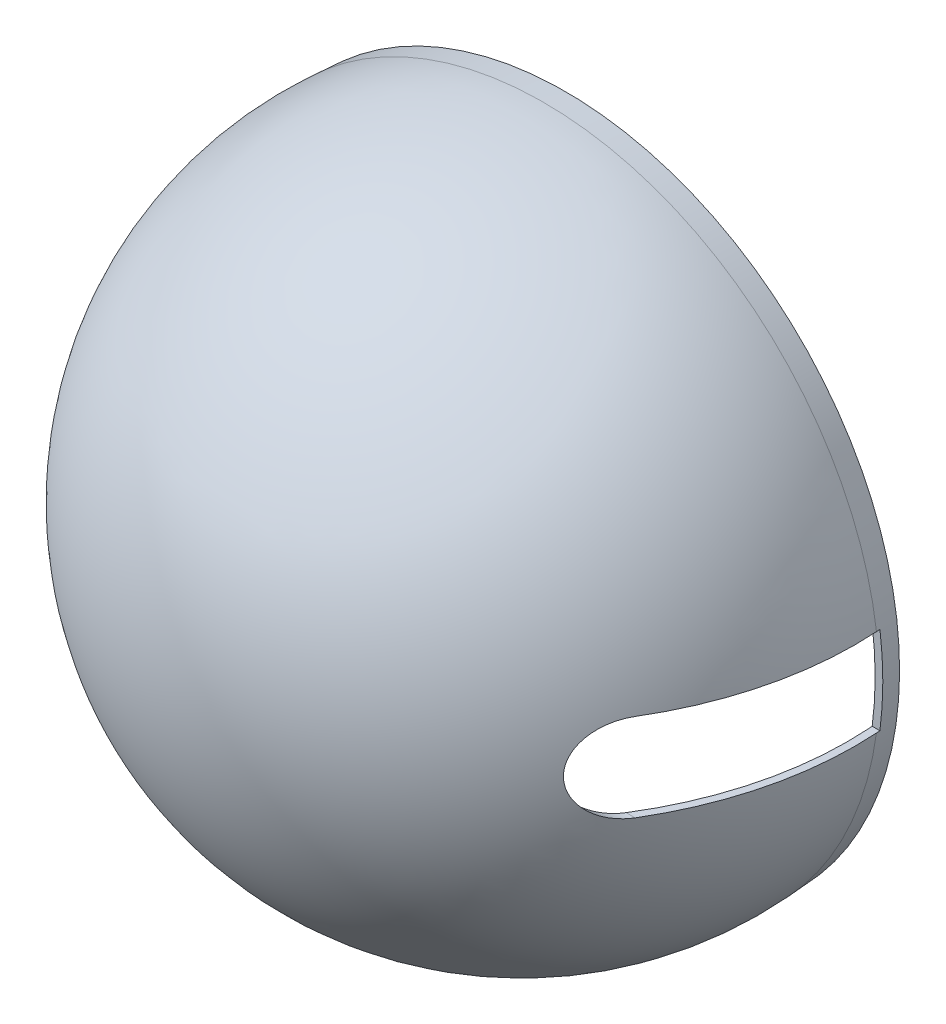
ISO-10303-21;
HEADER;
FILE_DESCRIPTION(('STEP AP214'),'2;1');
FILE_NAME('part.step','',(''),(''),'','','');
FILE_SCHEMA(('AUTOMOTIVE_DESIGN { 1 0 10303 214 1 1 1 1 }'));
ENDSEC;
DATA;
#1=APPLICATION_CONTEXT('core data for automotive mechanical design processes');
#2=APPLICATION_PROTOCOL_DEFINITION('international standard','automotive_design',2000,#1);
#3=PRODUCT_CONTEXT('',#1,'mechanical');
#4=PRODUCT('Part','Part','',(#3));
#5=PRODUCT_RELATED_PRODUCT_CATEGORY('part','',(#4));
#6=PRODUCT_DEFINITION_FORMATION('','',#4);
#7=PRODUCT_DEFINITION_CONTEXT('part definition',#1,'design');
#8=PRODUCT_DEFINITION('design','',#6,#7);
#9=PRODUCT_DEFINITION_SHAPE('','',#8);
#10=(LENGTH_UNIT() NAMED_UNIT(*) SI_UNIT(.MILLI.,.METRE.));
#11=(NAMED_UNIT(*) PLANE_ANGLE_UNIT() SI_UNIT($,.RADIAN.));
#12=(NAMED_UNIT(*) SI_UNIT($,.STERADIAN.) SOLID_ANGLE_UNIT());
#13=UNCERTAINTY_MEASURE_WITH_UNIT(LENGTH_MEASURE(1.E-05),#10,'distance_accuracy_value','');
#14=(GEOMETRIC_REPRESENTATION_CONTEXT(3) GLOBAL_UNCERTAINTY_ASSIGNED_CONTEXT((#13)) GLOBAL_UNIT_ASSIGNED_CONTEXT((#10,
#11,#12)) REPRESENTATION_CONTEXT('',''));
#15=CARTESIAN_POINT('',(0.,0.,0.));
#16=DIRECTION('',(0.,0.,1.));
#17=DIRECTION('',(1.,0.,0.));
#18=AXIS2_PLACEMENT_3D('',#15,#16,#17);
#19=CARTESIAN_POINT('',(-7.4,-7.37485392887751,5.71232051131699));
#20=DIRECTION('',(0.,0.,-1.));
#21=DIRECTION('',(1.,0.,0.));
#22=AXIS2_PLACEMENT_3D('',#19,#20,#21);
#23=SPHERICAL_SURFACE('',#22,44.0311091634147);
#24=CARTESIAN_POINT('',(-7.4,-13.1599999999998,5.71232051131699));
#25=DIRECTION('',(0.,1.,0.));
#26=DIRECTION('',(0.,0.,1.));
#27=AXIS2_PLACEMENT_3D('',#24,#25,#26);
#28=CIRCLE('',#27,43.6494061711763);
#29=CARTESIAN_POINT('',(29.9807926930625,-13.1599999999998,28.25));
#30=VERTEX_POINT('',#29);
#31=CARTESIAN_POINT('',(36.1546229401438,-13.1599999999998,2.83734579173678));
#32=VERTEX_POINT('',#31);
#33=EDGE_CURVE('E110',#30,#32,#28,.T.);
#34=ORIENTED_EDGE('',*,*,#33,.F.);
#35=CARTESIAN_POINT('',(29.9917241788752,-1.66000000347802,28.2498));
#36=CARTESIAN_POINT('',(29.8655198351829,-1.65999652353958,28.4591961454589));
#37=CARTESIAN_POINT('',(29.7388267561028,-1.67142377274834,28.6682986618103));
#38=CARTESIAN_POINT('',(29.4855242885027,-1.71698667701669,29.0842029864137));
#39=CARTESIAN_POINT('',(29.3589149683372,-1.75113311780648,29.2910036544507));
#40=CARTESIAN_POINT('',(29.1061419228296,-1.8422771924546,29.7017229245899));
#41=CARTESIAN_POINT('',(28.979986483986,-1.89942235390568,29.9056139470841));
#42=CARTESIAN_POINT('',(28.7302166895303,-2.03641087145871,30.3071900644101));
#43=CARTESIAN_POINT('',(28.6066017022425,-2.1162485100957,30.5048767085472));
#44=CARTESIAN_POINT('',(28.3764713211196,-2.28856513481136,30.8710265509414));
#45=CARTESIAN_POINT('',(28.2695573279622,-2.37872811243334,31.0403311947891));
#46=CARTESIAN_POINT('',(28.0598710333244,-2.57682888682756,31.370909308579));
#47=CARTESIAN_POINT('',(27.9570980444609,-2.68476371831688,31.5321841124855));
#48=CARTESIAN_POINT('',(27.7571896688599,-2.91783191386169,31.8445489113738));
#49=CARTESIAN_POINT('',(27.6600372559319,-3.04290899989241,31.9956699166096));
#50=CARTESIAN_POINT('',(27.472351129399,-3.31016859461381,32.2864393731834));
#51=CARTESIAN_POINT('',(27.3818150451704,-3.45234492787404,32.4260919358937));
#52=CARTESIAN_POINT('',(27.2322062741623,-3.71255001519797,32.6559998852711));
#53=CARTESIAN_POINT('',(27.1712414108996,-3.82672532627072,32.7494075674366));
#54=CARTESIAN_POINT('',(27.0542338402547,-4.06353968268544,32.9282159244304));
#55=CARTESIAN_POINT('',(26.9981900275648,-4.18617681632569,33.0136183975858));
#56=CARTESIAN_POINT('',(26.8916519952884,-4.43950967874915,33.1755755938759));
#57=CARTESIAN_POINT('',(26.8411592320999,-4.57020750839879,33.2521279953371));
#58=CARTESIAN_POINT('',(26.7464310198044,-4.83896190627782,33.3954289710494));
#59=CARTESIAN_POINT('',(26.7021924772422,-4.97701478970513,33.4621823926913));
#60=CARTESIAN_POINT('',(26.6203049688583,-5.2607963237842,33.5854972693375));
#61=CARTESIAN_POINT('',(26.5827069783573,-5.4065740518749,33.6419799725359));
#62=CARTESIAN_POINT('',(26.5151595715039,-5.70378273090054,33.7432644992443));
#63=CARTESIAN_POINT('',(26.4852064972948,-5.85521093835133,33.7880719092373));
#64=CARTESIAN_POINT('',(26.4334969430288,-6.16250804070676,33.8652783087379));
#65=CARTESIAN_POINT('',(26.4117371234786,-6.31837509845334,33.8976823538294));
#66=CARTESIAN_POINT('',(26.3768395938987,-6.63319662130508,33.9495188766121));
#67=CARTESIAN_POINT('',(26.3637007260228,-6.79215066885508,33.9689530962356));
#68=CARTESIAN_POINT('',(26.347359478267,-7.09247112317171,33.9929591712698));
#69=CARTESIAN_POINT('',(26.3431561091915,-7.23366572524682,33.9990313655991));
#70=CARTESIAN_POINT('',(26.3417109771464,-7.5161512318775,34.0007544733221));
#71=CARTESIAN_POINT('',(26.3444687859382,-7.65744212997454,33.9964060277744));
#72=CARTESIAN_POINT('',(26.3568980575563,-7.93898200615266,33.9773538425185));
#73=CARTESIAN_POINT('',(26.3665679632923,-8.07923121170792,33.9626524350364));
#74=CARTESIAN_POINT('',(26.392657984668,-8.3576530991926,33.9231143430592));
#75=CARTESIAN_POINT('',(26.4090781206773,-8.49582577485455,33.8982776279796));
#76=CARTESIAN_POINT('',(26.4475669157818,-8.76326073310221,33.8400893833075));
#77=CARTESIAN_POINT('',(26.4693641245173,-8.89265142930287,33.807147203166));
#78=CARTESIAN_POINT('',(26.5186005280019,-9.1478605326061,33.7327034624648));
#79=CARTESIAN_POINT('',(26.5460415292706,-9.27367778117285,33.6911991612456));
#80=CARTESIAN_POINT('',(26.6363075930181,-9.64464452378646,33.5545425647603));
#81=CARTESIAN_POINT('',(26.7071050872644,-9.88350845333036,33.4472023480707));
#82=CARTESIAN_POINT('',(26.8727806159669,-10.3571042139246,33.1951525771803));
#83=CARTESIAN_POINT('',(26.9690820708782,-10.5901355571066,33.0482194321252));
#84=CARTESIAN_POINT('',(27.1785190377185,-11.0281702546503,32.7271801889515));
#85=CARTESIAN_POINT('',(27.291661690385,-11.2331616488626,32.553062562962));
#86=CARTESIAN_POINT('',(27.5486893678905,-11.6411719175702,32.1554228903625));
#87=CARTESIAN_POINT('',(27.6946483986068,-11.8394656822513,31.9284010605724));
#88=CARTESIAN_POINT('',(27.9990282325189,-12.1953303948697,31.4518266560822));
#89=CARTESIAN_POINT('',(28.1574595302538,-12.352866559972,31.2022550806955));
#90=CARTESIAN_POINT('',(28.5086866086675,-12.648373496522,30.6451306630374));
#91=CARTESIAN_POINT('',(28.70292527358,-12.7791826282509,30.3346893035822));
#92=CARTESIAN_POINT('',(29.0971505969705,-12.9843140872341,29.6994130968637));
#93=CARTESIAN_POINT('',(29.2971333243588,-13.0586741338828,29.3745880146995));
#94=CARTESIAN_POINT('',(29.57818435566,-13.123048663345,28.9143697139725));
#95=CARTESIAN_POINT('',(29.6589088479745,-13.1369126155342,28.78175570039));
#96=CARTESIAN_POINT('',(29.8201125968115,-13.1553782348466,28.5160806321761));
#97=CARTESIAN_POINT('',(29.9005920283061,-13.1599973838401,28.3830208988075));
#98=CARTESIAN_POINT('',(29.9809132771493,-13.1599999965215,28.2498));
#99=B_SPLINE_CURVE_WITH_KNOTS('',3,(#35,#36,#37,#38,#39,#40,#41,#42,#43,#44,#45,#46,#47,#48,#49,
#50,#51,#52,#53,#54,#55,#56,#57,#58,#59,#60,#61,#62,#63,#64,#65,#66,#67,#68,#69,#70,#71,#72,#73,
#74,#75,#76,#77,#78,#79,#80,#81,#82,#83,#84,#85,#86,#87,#88,#89,#90,#91,#92,#93,#94,#95,#96,#97,
#98),.UNSPECIFIED.,.F.,.F.,(4,2,2,2,2,2,2,2,2,2,2,2,2,2,2,2,2,2,2,2,2,2,2,2,2,2,2,2,2,2,2,4),
(0.,0.733200342006287,1.46674901282694,2.20508007371185,2.94322527363382,3.60116959700803,
4.25900425159359,4.9147287804826,5.57021720017607,6.04861624741865,6.52690756603075,
7.00532407329094,7.48350311257268,7.96520680941862,8.44667959199377,8.92795591782682,
9.40916759209157,9.8327891080097,10.2563845641727,10.6798846269135,11.1033859676249,
11.5087845973176,11.9143131934412,12.7247581940987,13.5969325647711,14.4694777999811,
15.4703641322797,16.4721018315959,17.6340925226984,18.7953060841347,19.2626936136111,
19.7291964776892),.UNSPECIFIED.);
#100=CARTESIAN_POINT('',(29.991603629659,-1.65999999999976,28.25));
#101=VERTEX_POINT('',#100);
#102=EDGE_CURVE('E106',#101,#30,#99,.T.);
#103=ORIENTED_EDGE('',*,*,#102,.F.);
#104=CARTESIAN_POINT('',(-7.4,-1.65999999999976,5.71232051131699));
#105=DIRECTION('',(0.,-1.,0.));
#106=DIRECTION('',(0.,0.,-1.));
#107=AXIS2_PLACEMENT_3D('',#104,#105,#106);
#108=CIRCLE('',#107,43.6586648757395);
#109=CARTESIAN_POINT('',(36.1639017891408,-1.65999999999976,2.83734579173678));
#110=VERTEX_POINT('',#109);
#111=EDGE_CURVE('E90',#110,#101,#108,.T.);
#112=ORIENTED_EDGE('',*,*,#111,.F.);
#113=CARTESIAN_POINT('',(-7.39999999999999,-7.37485392887751,2.83734579173677));
#114=DIRECTION('',(0.,0.,-1.));
#115=DIRECTION('',(-1.,0.,0.));
#116=AXIS2_PLACEMENT_3D('',#113,#114,#115);
#117=CIRCLE('',#116,43.9371493672759);
#118=EDGE_CURVE('E111',#32,#110,#117,.T.);
#119=ORIENTED_EDGE('',*,*,#118,.F.);
#120=EDGE_LOOP('',(#34,#103,#112,#119));
#121=FACE_BOUND('',#120,.T.);
#122=ADVANCED_FACE('F34',(#121),#23,.T.);
#123=CARTESIAN_POINT('',(-7.4,-7.37485392887751,5.71232051131699));
#124=DIRECTION('',(0.,0.,-1.));
#125=DIRECTION('',(1.,0.,0.));
#126=AXIS2_PLACEMENT_3D('',#123,#124,#125);
#127=SPHERICAL_SURFACE('',#126,43.0311091634145);
#128=CARTESIAN_POINT('',(28.808822388228,-1.66000000347802,28.2498));
#129=CARTESIAN_POINT('',(28.6797794668725,-1.65999895641255,28.4571327307231));
#130=CARTESIAN_POINT('',(28.5502198493448,-1.67119966780408,28.6641431246154));
#131=CARTESIAN_POINT('',(28.291112073482,-1.71585091398192,29.0758841446676));
#132=CARTESIAN_POINT('',(28.1615639447322,-1.74931114044759,29.2806137382839));
#133=CARTESIAN_POINT('',(27.9027301954585,-1.83864087310181,29.6874016844247));
#134=CARTESIAN_POINT('',(27.7734528479286,-1.89466652772861,29.8894310731782));
#135=CARTESIAN_POINT('',(27.517322218921,-2.02899424443825,30.2874958279288));
#136=CARTESIAN_POINT('',(27.3904684161574,-2.10729145717601,30.4835324884859));
#137=CARTESIAN_POINT('',(27.1519466163621,-2.27786391922958,30.8501403506082));
#138=CARTESIAN_POINT('',(27.0399514017629,-2.36820383701742,31.0214000730357));
#139=CARTESIAN_POINT('',(26.8201477410696,-2.56709426346768,31.3559010386291));
#140=CARTESIAN_POINT('',(26.7123395072117,-2.67564569378426,31.5191418754319));
#141=CARTESIAN_POINT('',(26.502542235661,-2.9103913529733,31.8353404971667));
#142=CARTESIAN_POINT('',(26.4005346075824,-3.03652415573333,31.9883314500837));
#143=CARTESIAN_POINT('',(26.2033797777591,-3.30641034664664,32.2827277165461));
#144=CARTESIAN_POINT('',(26.1082298949738,-3.45015678873534,32.4241375607142));
#145=CARTESIAN_POINT('',(25.9521856586928,-3.71151703261869,32.6551021981937));
#146=CARTESIAN_POINT('',(25.8892300297738,-3.82497846408699,32.7479885059533));
#147=CARTESIAN_POINT('',(25.7682968716948,-4.06037036945842,32.9259208681593));
#148=CARTESIAN_POINT('',(25.7103181700045,-4.18229883627233,33.0109687696309));
#149=CARTESIAN_POINT('',(25.5999964607549,-4.43425501455092,33.1723806444745));
#150=CARTESIAN_POINT('',(25.5476548961394,-4.5642847863336,33.2487423947231));
#151=CARTESIAN_POINT('',(25.4493547573748,-4.83177806392754,33.3918150754081));
#152=CARTESIAN_POINT('',(25.4033930064306,-4.96923782229361,33.4585308097218));
#153=CARTESIAN_POINT('',(25.3181926547518,-5.25201004737558,33.5819378835533));
#154=CARTESIAN_POINT('',(25.2790102463675,-5.39737613238635,33.6385455528438));
#155=CARTESIAN_POINT('',(25.2085260425666,-5.69388693176402,33.7401731618543));
#156=CARTESIAN_POINT('',(25.1772203856103,-5.84502877256707,33.7851987798627));
#157=CARTESIAN_POINT('',(25.1230891575982,-6.1518698117376,33.8628996411081));
#158=CARTESIAN_POINT('',(25.1002595644081,-6.30756681061535,33.895580742299));
#159=CARTESIAN_POINT('',(25.0635470026904,-6.62215700726783,33.9480014061407));
#160=CARTESIAN_POINT('',(25.0496627196059,-6.78104973187445,33.9677428703414));
#161=CARTESIAN_POINT('',(25.0323190981452,-7.08020461167753,33.9922403778392));
#162=CARTESIAN_POINT('',(25.0277617851053,-7.22027651922053,33.9985781910386));
#163=CARTESIAN_POINT('',(25.025778804131,-7.5005561556311,34.0009942289379));
#164=CARTESIAN_POINT('',(25.0283526588932,-7.64076387478062,33.9970731402873));
#165=CARTESIAN_POINT('',(25.0405854387998,-7.92017441770427,33.9790329260991));
#166=CARTESIAN_POINT('',(25.0502427503,-8.05937746305559,33.9649161232035));
#167=CARTESIAN_POINT('',(25.0764726576374,-8.33574257566478,33.9267034659349));
#168=CARTESIAN_POINT('',(25.0930452688472,-8.47290463838487,33.9026075893786));
#169=CARTESIAN_POINT('',(25.1318943419266,-8.73780271944915,33.8461506252542));
#170=CARTESIAN_POINT('',(25.1538652094511,-8.86567833702854,33.8142325419702));
#171=CARTESIAN_POINT('',(25.2035224441612,-9.11793167686742,33.7420585041034));
#172=CARTESIAN_POINT('',(25.2312106314045,-9.24230827088257,33.701799894375));
#173=CARTESIAN_POINT('',(25.322310609551,-9.60909087058922,33.5692062472534));
#174=CARTESIAN_POINT('',(25.3937871335964,-9.84534483279408,33.4650109662234));
#175=CARTESIAN_POINT('',(25.5613570736272,-10.3149722335061,33.2198527533281));
#176=CARTESIAN_POINT('',(25.6589647351904,-10.546595955762,33.0766116852049));
#177=CARTESIAN_POINT('',(25.8712244960918,-10.9824093342515,32.7635836051993));
#178=CARTESIAN_POINT('',(25.9858841813905,-11.1865867030201,32.5937847767776));
#179=CARTESIAN_POINT('',(26.247363732946,-11.5953110143093,32.2043986472999));
#180=CARTESIAN_POINT('',(26.396411040713,-11.7949610627568,31.9811758563285));
#181=CARTESIAN_POINT('',(26.7072426730002,-12.1541330798807,31.5123669018734));
#182=CARTESIAN_POINT('',(26.8690376660977,-12.3136209581621,31.2667619792043));
#183=CARTESIAN_POINT('',(27.2294401788299,-12.6155716603545,30.7156328795139));
#184=CARTESIAN_POINT('',(27.4296271006136,-12.7505198700851,30.4070241089997));
#185=CARTESIAN_POINT('',(27.8360592906736,-12.9641229179769,29.7749262728029));
#186=CARTESIAN_POINT('',(28.0423013359853,-13.0428071579028,29.4514450731818));
#187=CARTESIAN_POINT('',(28.340594514794,-13.1154190934536,28.9795099202204));
#188=CARTESIAN_POINT('',(28.4322249335808,-13.1321434997877,28.8339875154461));
#189=CARTESIAN_POINT('',(28.6151935412695,-13.1544209912064,28.5423109432169));
#190=CARTESIAN_POINT('',(28.7065319494594,-13.1599961455049,28.3961585988514));
#191=CARTESIAN_POINT('',(28.7976581992111,-13.1599999965215,28.2498));
#192=B_SPLINE_CURVE_WITH_KNOTS('',3,(#128,#129,#130,#131,#132,#133,#134,#135,#136,#137,#138,
#139,#140,#141,#142,#143,#144,#145,#146,#147,#148,#149,#150,#151,#152,#153,#154,#155,#156,#157,
#158,#159,#160,#161,#162,#163,#164,#165,#166,#167,#168,#169,#170,#171,#172,#173,#174,#175,#176,
#177,#178,#179,#180,#181,#182,#183,#184,#185,#186,#187,#188,#189,#190,#191),.UNSPECIFIED.,.F.,
.F.,(4,2,2,2,2,2,2,2,2,2,2,2,2,2,2,2,2,2,2,2,2,2,2,2,2,2,2,2,2,2,2,4),(0.,0.732377269236326,
1.46507362068034,2.20292967243979,2.94062518836056,3.61080026548235,4.28100926927945,
4.94893279028456,5.6165937535142,6.09487943307615,6.57305212072154,7.05134691726245,
7.52940268840267,8.01124863792828,8.49285790248092,8.97423833670413,9.45554801358251,
9.87587456704036,10.2961729878893,10.7163756925404,11.1365793313027,11.5369810761556,
11.9375104823808,12.7379705501001,13.6026099103473,14.4676350811122,15.4674085478861,
16.4680278019316,17.6389089341873,18.8091777530876,19.3272155319413,19.8442268699352),.UNSPECIFIED.);
#193=CARTESIAN_POINT('',(28.8086979007902,-1.65999999999976,28.25));
#194=VERTEX_POINT('',#193);
#195=CARTESIAN_POINT('',(28.7975336733717,-13.1599999999998,28.25));
#196=VERTEX_POINT('',#195);
#197=EDGE_CURVE('E11',#194,#196,#192,.T.);
#198=ORIENTED_EDGE('',*,*,#197,.T.);
#199=CARTESIAN_POINT('',(-7.4,-13.1599999999998,5.71232051131699));
#200=DIRECTION('',(0.,1.,0.));
#201=DIRECTION('',(0.,0.,1.));
#202=AXIS2_PLACEMENT_3D('',#199,#200,#201);
#203=CIRCLE('',#202,42.6404554474912);
#204=CARTESIAN_POINT('',(35.147786499157,-13.1599999999998,2.90263996156811));
#205=VERTEX_POINT('',#204);
#206=EDGE_CURVE('E112',#196,#205,#203,.T.);
#207=ORIENTED_EDGE('',*,*,#206,.T.);
#208=CARTESIAN_POINT('',(-7.39999999999999,-7.37485392887751,2.9026399615681));
#209=DIRECTION('',(0.,0.,-1.));
#210=DIRECTION('',(-1.,0.,0.));
#211=AXIS2_PLACEMENT_3D('',#208,#209,#210);
#212=CIRCLE('',#211,42.9392833084352);
#213=CARTESIAN_POINT('',(35.1572848712609,-1.65999999999976,2.90263996156811));
#214=VERTEX_POINT('',#213);
#215=EDGE_CURVE('E158',#205,#214,#212,.T.);
#216=ORIENTED_EDGE('',*,*,#215,.T.);
#217=CARTESIAN_POINT('',(-7.4,-1.65999999999976,5.71232051131699));
#218=DIRECTION('',(0.,-1.,0.));
#219=DIRECTION('',(0.,0.,-1.));
#220=AXIS2_PLACEMENT_3D('',#217,#218,#219);
#221=CIRCLE('',#220,42.6499331817213);
#222=EDGE_CURVE('E54',#214,#194,#221,.T.);
#223=ORIENTED_EDGE('',*,*,#222,.T.);
#224=EDGE_LOOP('',(#198,#207,#216,#223));
#225=FACE_BOUND('',#224,.T.);
#226=ADVANCED_FACE('F174',(#225),#127,.F.);
#227=CARTESIAN_POINT('',(-7.39999999999999,-7.37485392887751,2.9026399615681));
#228=DIRECTION('',(0.,0.,1.));
#229=DIRECTION('',(1.,0.,0.));
#230=AXIS2_PLACEMENT_3D('',#227,#228,#229);
#231=CONICAL_SURFACE('',#230,42.9392833084352,0.0653406541505501);
#232=CARTESIAN_POINT('',(-7.39999999999999,-7.37485392887751,0.));
#233=DIRECTION('',(0.,0.,-1.));
#234=DIRECTION('',(-1.,0.,0.));
#235=AXIS2_PLACEMENT_3D('',#232,#233,#234);
#236=CIRCLE('',#235,42.7493525407426);
#237=CARTESIAN_POINT('',(-50.1493525407426,-7.37485392887751,0.));
#238=VERTEX_POINT('',#237);
#239=EDGE_CURVE('E160',#238,#238,#236,.T.);
#240=ORIENTED_EDGE('',*,*,#239,.T.);
#241=EDGE_LOOP('',(#240));
#242=FACE_BOUND('',#241,.T.);
#243=ORIENTED_EDGE('',*,*,#215,.F.);
#244=CARTESIAN_POINT('',(37.4938395169571,-13.1599999999998,38.4464494557724));
#245=CARTESIAN_POINT('',(37.0999558784973,-13.1599999999998,32.4762444314977));
#246=CARTESIAN_POINT('',(36.7059884519773,-13.1599999999998,26.50604493467));
#247=CARTESIAN_POINT('',(35.9178708053517,-13.1599999999998,14.5656580129315));
#248=CARTESIAN_POINT('',(35.5237205852463,-13.1599999999998,8.59547058802077));
#249=CARTESIAN_POINT('',(34.7352221330432,-13.1599999999998,-3.34489118713215));
#250=CARTESIAN_POINT('',(34.3408739009454,-13.1599999999998,-9.31506553737437));
#251=CARTESIAN_POINT('',(33.5519614236907,-13.1599999999998,-21.25539997217));
#252=CARTESIAN_POINT('',(33.1573971785336,-13.1599999999998,-27.2255600567235));
#253=CARTESIAN_POINT('',(32.7627159267188,-13.1599999999998,-33.1957124067847));
#254=B_SPLINE_CURVE_WITH_KNOTS('',3,(#244,#245,#246,#247,#248,#249,#250,#251,#252,#253),
.UNSPECIFIED.,.F.,.F.,(4,2,2,2,4),(0.,17.9495523948432,35.8991047697357,53.8486571476357,
71.798209545493),.UNSPECIFIED.);
#255=CARTESIAN_POINT('',(35.1111664858264,-13.1599999999998,2.3480970874196));
#256=VERTEX_POINT('',#255);
#257=EDGE_CURVE('E117',#205,#256,#254,.T.);
#258=ORIENTED_EDGE('',*,*,#257,.T.);
#259=CARTESIAN_POINT('',(-7.39999999999999,-7.37485392887751,2.3480970874196));
#260=DIRECTION('',(0.,0.,1.));
#261=DIRECTION('',(0.,-1.,0.));
#262=AXIS2_PLACEMENT_3D('',#259,#260,#261);
#263=CIRCLE('',#262,42.9029974599662);
#264=CARTESIAN_POINT('',(35.1206730381994,-1.65999999999976,2.3480970874196));
#265=VERTEX_POINT('',#264);
#266=EDGE_CURVE('E177',#256,#265,#263,.T.);
#267=ORIENTED_EDGE('',*,*,#266,.T.);
#268=CARTESIAN_POINT('',(32.7727782241423,-1.65999999999976,-33.1957124067847));
#269=CARTESIAN_POINT('',(33.1673606734149,-1.65999999999976,-27.2255593600068));
#270=CARTESIAN_POINT('',(33.5618290268702,-1.65999999999976,-21.2553987730236));
#271=CARTESIAN_POINT('',(34.3505550873039,-1.65999999999976,-9.31506369091325));
#272=CARTESIAN_POINT('',(34.7448127942824,-1.65999999999976,-3.34488919578609));
#273=CARTESIAN_POINT('',(35.5331351076913,-1.65999999999976,8.59547254201959));
#274=CARTESIAN_POINT('',(35.9271997141216,-1.65999999999976,14.5656597846981));
#275=CARTESIAN_POINT('',(36.7151506614005,-1.65999999999976,26.5060460402856));
#276=CARTESIAN_POINT('',(37.1090370022489,-1.65999999999976,32.4762450531947));
#277=CARTESIAN_POINT('',(37.5028416273415,-1.65999999999976,38.4464494557724));
#278=B_SPLINE_CURVE_WITH_KNOTS('',3,(#268,#269,#270,#271,#272,#273,#274,#275,#276,#277),
.UNSPECIFIED.,.F.,.F.,(4,2,2,2,4),(0.,17.9495349334463,35.8990698479134,53.8486047595206,
71.7981396901009),.UNSPECIFIED.);
#279=EDGE_CURVE('E100',#265,#214,#278,.T.);
#280=ORIENTED_EDGE('',*,*,#279,.T.);
#281=EDGE_LOOP('',(#243,#258,#267,#280));
#282=FACE_BOUND('',#281,.T.);
#283=ADVANCED_FACE('F138',(#242,#282),#231,.F.);
#284=CARTESIAN_POINT('',(-7.39999999999999,-7.37485392887751,0.));
#285=DIRECTION('',(0.,0.,1.));
#286=DIRECTION('',(1.,0.,0.));
#287=AXIS2_PLACEMENT_3D('',#284,#285,#286);
#288=CONICAL_SURFACE('',#287,43.7514910453452,0.065340654150552);
#289=CARTESIAN_POINT('',(-7.39999999999999,-7.37485392887751,0.));
#290=DIRECTION('',(0.,0.,-1.));
#291=DIRECTION('',(-1.,0.,0.));
#292=AXIS2_PLACEMENT_3D('',#289,#290,#291);
#293=CIRCLE('',#292,43.7514910453452);
#294=CARTESIAN_POINT('',(-51.1514910453452,-7.37485392887751,0.));
#295=VERTEX_POINT('',#294);
#296=EDGE_CURVE('E114',#295,#295,#293,.T.);
#297=ORIENTED_EDGE('',*,*,#296,.F.);
#298=EDGE_LOOP('',(#297));
#299=FACE_BOUND('',#298,.T.);
#300=CARTESIAN_POINT('',(-7.39999999999999,-7.37485392887752,2.3480970874196));
#301=DIRECTION('',(0.,0.,1.));
#302=DIRECTION('',(0.,-1.,0.));
#303=AXIS2_PLACEMENT_3D('',#300,#301,#302);
#304=CIRCLE('',#303,43.9051359645688);
#305=CARTESIAN_POINT('',(36.1316138988536,-1.65999999999976,2.3480970874196));
#306=VERTEX_POINT('',#305);
#307=CARTESIAN_POINT('',(36.1223281661615,-13.1599999999998,2.3480970874196));
#308=VERTEX_POINT('',#307);
#309=EDGE_CURVE('E155',#306,#308,#304,.F.);
#310=ORIENTED_EDGE('',*,*,#309,.T.);
#311=CARTESIAN_POINT('',(33.7090772697606,-13.1599999999998,-34.1925277620715));
#312=CARTESIAN_POINT('',(34.1141944306173,-13.1599999999998,-28.0616802185999));
#313=CARTESIAN_POINT('',(34.5191965314132,-13.1599999999998,-21.9308250728027));
#314=CARTESIAN_POINT('',(35.3289883575344,-13.1599999999998,-9.66910076162486));
#315=CARTESIAN_POINT('',(35.73377808286,-13.1599999999998,-3.53823159624417));
#316=CARTESIAN_POINT('',(36.5431629034547,-13.1599999999998,8.72351958057991));
#317=CARTESIAN_POINT('',(36.9477579987239,-13.1599999999998,14.8544015920233));
#318=CARTESIAN_POINT('',(37.7567685550681,-13.1599999999998,27.1161774732045));
#319=CARTESIAN_POINT('',(38.161184016143,-13.1599999999998,33.2470713429424));
#320=CARTESIAN_POINT('',(38.5655171576087,-13.1599999999998,39.3779706412279));
#321=B_SPLINE_CURVE_WITH_KNOTS('',3,(#311,#312,#313,#314,#315,#316,#317,#318,#319,#320),
.UNSPECIFIED.,.F.,.F.,(4,2,2,2,4),(0.,18.4326531883625,36.8653063579481,55.2979595246946,
73.7306127102119),.UNSPECIFIED.);
#322=EDGE_CURVE('E47',#308,#32,#321,.T.);
#323=ORIENTED_EDGE('',*,*,#322,.T.);
#324=ORIENTED_EDGE('',*,*,#118,.T.);
#325=CARTESIAN_POINT('',(38.5743094260505,-1.65999999999976,39.3779706412279));
#326=CARTESIAN_POINT('',(38.1700536572756,-1.65999999999976,33.24707195275));
#327=CARTESIAN_POINT('',(37.7657176026782,-1.65999999999976,27.1161785577));
#328=CARTESIAN_POINT('',(36.9568703039341,-1.65999999999976,14.8544033300023));
#329=CARTESIAN_POINT('',(36.5523590597876,-1.65999999999976,8.72352149735446));
#330=CARTESIAN_POINT('',(35.7431467631985,-1.65999999999976,-3.53822964276657));
#331=CARTESIAN_POINT('',(35.338445710756,-1.65999999999976,-9.66909895023978));
#332=CARTESIAN_POINT('',(34.5288364999204,-1.65999999999976,-21.9308238963968));
#333=CARTESIAN_POINT('',(34.123928341527,-1.65999999999976,-28.0616795350806));
#334=CARTESIAN_POINT('',(33.7189079816933,-1.65999999999976,-34.1925277620715));
#335=B_SPLINE_CURVE_WITH_KNOTS('',3,(#325,#326,#327,#328,#329,#330,#331,#332,#333,#334),
.UNSPECIFIED.,.F.,.F.,(4,2,2,2,4),(0.,18.4326360864934,36.8652721551347,55.2979082264758,
73.7305443156748),.UNSPECIFIED.);
#336=EDGE_CURVE('E95',#110,#306,#335,.T.);
#337=ORIENTED_EDGE('',*,*,#336,.T.);
#338=EDGE_LOOP('',(#310,#323,#324,#337));
#339=FACE_BOUND('',#338,.T.);
#340=ADVANCED_FACE('F133',(#299,#339),#288,.T.);
#341=CARTESIAN_POINT('',(0.,-7.37485392887751,0.));
#342=DIRECTION('',(0.,0.,-1.));
#343=DIRECTION('',(-1.,0.,0.));
#344=AXIS2_PLACEMENT_3D('',#341,#342,#343);
#345=PLANE('',#344);
#346=ORIENTED_EDGE('',*,*,#296,.T.);
#347=EDGE_LOOP('',(#346));
#348=FACE_BOUND('',#347,.T.);
#349=ORIENTED_EDGE('',*,*,#239,.F.);
#350=EDGE_LOOP('',(#349));
#351=FACE_BOUND('',#350,.T.);
#352=ADVANCED_FACE('F130',(#348,#351),#345,.T.);
#353=CARTESIAN_POINT('',(36.6311091634147,-7.40999999999976,28.25));
#354=DIRECTION('',(-1.,0.,0.));
#355=DIRECTION('',(0.,0.,1.));
#356=AXIS2_PLACEMENT_3D('',#353,#354,#355);
#357=CYLINDRICAL_SURFACE('',#356,5.75);
#358=ORIENTED_EDGE('',*,*,#102,.T.);
#359=DIRECTION('',(-1.,0.,0.));
#360=VECTOR('',#359,1.);
#361=CARTESIAN_POINT('',(36.6311091634147,-13.1599999999998,28.25));
#362=LINE('',#361,#360);
#363=EDGE_CURVE('E101',#30,#196,#362,.T.);
#364=ORIENTED_EDGE('',*,*,#363,.T.);
#365=ORIENTED_EDGE('',*,*,#197,.F.);
#366=DIRECTION('',(-1.,0.,0.));
#367=VECTOR('',#366,1.);
#368=CARTESIAN_POINT('',(36.6311091634147,-1.65999999999976,28.25));
#369=LINE('',#368,#367);
#370=EDGE_CURVE('E93',#101,#194,#369,.T.);
#371=ORIENTED_EDGE('',*,*,#370,.F.);
#372=EDGE_LOOP('',(#358,#364,#365,#371));
#373=FACE_BOUND('',#372,.T.);
#374=ADVANCED_FACE('F104',(#373),#357,.F.);
#375=CARTESIAN_POINT('',(36.6311091634147,-13.1599999999998,2.3480970874196));
#376=DIRECTION('',(0.,1.,0.));
#377=DIRECTION('',(0.,0.,1.));
#378=AXIS2_PLACEMENT_3D('',#375,#376,#377);
#379=PLANE('',#378);
#380=ORIENTED_EDGE('',*,*,#363,.F.);
#381=ORIENTED_EDGE('',*,*,#33,.T.);
#382=ORIENTED_EDGE('',*,*,#322,.F.);
#383=DIRECTION('',(-1.,0.,0.));
#384=VECTOR('',#383,1.);
#385=CARTESIAN_POINT('',(36.6311091634147,-13.1599999999998,2.3480970874196));
#386=LINE('',#385,#384);
#387=EDGE_CURVE('E205',#308,#256,#386,.T.);
#388=ORIENTED_EDGE('',*,*,#387,.T.);
#389=ORIENTED_EDGE('',*,*,#257,.F.);
#390=ORIENTED_EDGE('',*,*,#206,.F.);
#391=EDGE_LOOP('',(#380,#381,#382,#388,#389,#390));
#392=FACE_BOUND('',#391,.T.);
#393=ADVANCED_FACE('F129',(#392),#379,.T.);
#394=CARTESIAN_POINT('',(36.6311091634147,-1.65999999999976,28.25));
#395=DIRECTION('',(0.,-1.,0.));
#396=DIRECTION('',(0.,0.,-1.));
#397=AXIS2_PLACEMENT_3D('',#394,#395,#396);
#398=PLANE('',#397);
#399=ORIENTED_EDGE('',*,*,#279,.F.);
#400=DIRECTION('',(-1.,0.,0.));
#401=VECTOR('',#400,1.);
#402=CARTESIAN_POINT('',(36.6311091634147,-1.65999999999976,2.3480970874196));
#403=LINE('',#402,#401);
#404=EDGE_CURVE('E60',#306,#265,#403,.T.);
#405=ORIENTED_EDGE('',*,*,#404,.F.);
#406=ORIENTED_EDGE('',*,*,#336,.F.);
#407=ORIENTED_EDGE('',*,*,#111,.T.);
#408=ORIENTED_EDGE('',*,*,#370,.T.);
#409=ORIENTED_EDGE('',*,*,#222,.F.);
#410=EDGE_LOOP('',(#399,#405,#406,#407,#408,#409));
#411=FACE_BOUND('',#410,.T.);
#412=ADVANCED_FACE('F92',(#411),#398,.T.);
#413=CARTESIAN_POINT('',(36.6311091634147,-13.1599999999998,2.3480970874196));
#414=DIRECTION('',(0.,0.,1.));
#415=DIRECTION('',(0.,-1.,0.));
#416=AXIS2_PLACEMENT_3D('',#413,#414,#415);
#417=PLANE('',#416);
#418=ORIENTED_EDGE('',*,*,#387,.F.);
#419=ORIENTED_EDGE('',*,*,#309,.F.);
#420=ORIENTED_EDGE('',*,*,#404,.T.);
#421=ORIENTED_EDGE('',*,*,#266,.F.);
#422=EDGE_LOOP('',(#418,#419,#420,#421));
#423=FACE_BOUND('',#422,.T.);
#424=ADVANCED_FACE('F189',(#423),#417,.T.);
#425=CLOSED_SHELL('',(#122,#226,#283,#340,#352,#374,#393,#412,#424));
#426=MANIFOLD_SOLID_BREP('B2',#425);
#427=ADVANCED_BREP_SHAPE_REPRESENTATION('',(#18,#426),#14);
#428=SHAPE_DEFINITION_REPRESENTATION(#9,#427);
ENDSEC;
END-ISO-10303-21;
